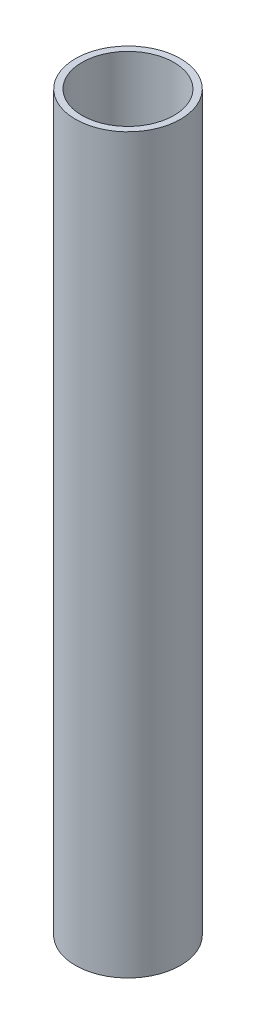
ISO-10303-21;
HEADER;
FILE_DESCRIPTION(('STEP AP214'),'2;1');
FILE_NAME('part.step','',(''),(''),'','','');
FILE_SCHEMA(('AUTOMOTIVE_DESIGN { 1 0 10303 214 1 1 1 1 }'));
ENDSEC;
DATA;
#1=APPLICATION_CONTEXT('core data for automotive mechanical design processes');
#2=APPLICATION_PROTOCOL_DEFINITION('international standard','automotive_design',2000,#1);
#3=PRODUCT_CONTEXT('',#1,'mechanical');
#4=PRODUCT('Part','Part','',(#3));
#5=PRODUCT_RELATED_PRODUCT_CATEGORY('part','',(#4));
#6=PRODUCT_DEFINITION_FORMATION('','',#4);
#7=PRODUCT_DEFINITION_CONTEXT('part definition',#1,'design');
#8=PRODUCT_DEFINITION('design','',#6,#7);
#9=PRODUCT_DEFINITION_SHAPE('','',#8);
#10=(LENGTH_UNIT() NAMED_UNIT(*) SI_UNIT(.MILLI.,.METRE.));
#11=(NAMED_UNIT(*) PLANE_ANGLE_UNIT() SI_UNIT($,.RADIAN.));
#12=(NAMED_UNIT(*) SI_UNIT($,.STERADIAN.) SOLID_ANGLE_UNIT());
#13=UNCERTAINTY_MEASURE_WITH_UNIT(LENGTH_MEASURE(1.E-05),#10,'distance_accuracy_value','');
#14=(GEOMETRIC_REPRESENTATION_CONTEXT(3) GLOBAL_UNCERTAINTY_ASSIGNED_CONTEXT((#13)) GLOBAL_UNIT_ASSIGNED_CONTEXT((#10,
#11,#12)) REPRESENTATION_CONTEXT('',''));
#15=CARTESIAN_POINT('',(0.,0.,0.));
#16=DIRECTION('',(0.,0.,1.));
#17=DIRECTION('',(1.,0.,0.));
#18=AXIS2_PLACEMENT_3D('',#15,#16,#17);
#19=CARTESIAN_POINT('',(0.,170.,0.));
#20=DIRECTION('',(0.,1.,0.));
#21=DIRECTION('',(0.,0.,1.));
#22=AXIS2_PLACEMENT_3D('',#19,#20,#21);
#23=PLANE('',#22);
#24=CARTESIAN_POINT('',(0.,170.,0.));
#25=DIRECTION('',(0.,1.,0.));
#26=DIRECTION('',(0.,0.,1.));
#27=AXIS2_PLACEMENT_3D('',#24,#25,#26);
#28=CIRCLE('',#27,12.192);
#29=CARTESIAN_POINT('',(0.,170.,12.192));
#30=VERTEX_POINT('',#29);
#31=EDGE_CURVE('E10',#30,#30,#28,.T.);
#32=ORIENTED_EDGE('',*,*,#31,.T.);
#33=EDGE_LOOP('',(#32));
#34=FACE_BOUND('',#33,.T.);
#35=CARTESIAN_POINT('',(0.,170.,0.));
#36=DIRECTION('',(0.,1.,0.));
#37=DIRECTION('',(0.,0.,1.));
#38=AXIS2_PLACEMENT_3D('',#35,#36,#37);
#39=CIRCLE('',#38,10.668);
#40=CARTESIAN_POINT('',(0.,170.,10.668));
#41=VERTEX_POINT('',#40);
#42=EDGE_CURVE('E42',#41,#41,#39,.T.);
#43=ORIENTED_EDGE('',*,*,#42,.F.);
#44=EDGE_LOOP('',(#43));
#45=FACE_BOUND('',#44,.T.);
#46=ADVANCED_FACE('F31',(#34,#45),#23,.T.);
#47=CARTESIAN_POINT('',(0.,0.,0.));
#48=DIRECTION('',(0.,1.,0.));
#49=DIRECTION('',(0.,0.,1.));
#50=AXIS2_PLACEMENT_3D('',#47,#48,#49);
#51=PLANE('',#50);
#52=CARTESIAN_POINT('',(0.,0.,0.));
#53=DIRECTION('',(0.,1.,0.));
#54=DIRECTION('',(0.,0.,1.));
#55=AXIS2_PLACEMENT_3D('',#52,#53,#54);
#56=CIRCLE('',#55,12.192);
#57=CARTESIAN_POINT('',(0.,0.,12.192));
#58=VERTEX_POINT('',#57);
#59=EDGE_CURVE('E35',#58,#58,#56,.T.);
#60=ORIENTED_EDGE('',*,*,#59,.F.);
#61=EDGE_LOOP('',(#60));
#62=FACE_BOUND('',#61,.T.);
#63=CARTESIAN_POINT('',(0.,0.,0.));
#64=DIRECTION('',(0.,1.,0.));
#65=DIRECTION('',(0.,0.,1.));
#66=AXIS2_PLACEMENT_3D('',#63,#64,#65);
#67=CIRCLE('',#66,10.668);
#68=CARTESIAN_POINT('',(0.,0.,10.668));
#69=VERTEX_POINT('',#68);
#70=EDGE_CURVE('E44',#69,#69,#67,.T.);
#71=ORIENTED_EDGE('',*,*,#70,.T.);
#72=EDGE_LOOP('',(#71));
#73=FACE_BOUND('',#72,.T.);
#74=ADVANCED_FACE('F54',(#62,#73),#51,.F.);
#75=CARTESIAN_POINT('',(0.,170.,0.));
#76=DIRECTION('',(0.,-1.,0.));
#77=DIRECTION('',(0.,0.,-1.));
#78=AXIS2_PLACEMENT_3D('',#75,#76,#77);
#79=CYLINDRICAL_SURFACE('',#78,12.192);
#80=ORIENTED_EDGE('',*,*,#31,.F.);
#81=EDGE_LOOP('',(#80));
#82=FACE_BOUND('',#81,.T.);
#83=ORIENTED_EDGE('',*,*,#59,.T.);
#84=EDGE_LOOP('',(#83));
#85=FACE_BOUND('',#84,.T.);
#86=ADVANCED_FACE('F33',(#82,#85),#79,.T.);
#87=CARTESIAN_POINT('',(0.,170.,0.));
#88=DIRECTION('',(0.,-1.,0.));
#89=DIRECTION('',(0.,0.,-1.));
#90=AXIS2_PLACEMENT_3D('',#87,#88,#89);
#91=CYLINDRICAL_SURFACE('',#90,10.668);
#92=ORIENTED_EDGE('',*,*,#42,.T.);
#93=EDGE_LOOP('',(#92));
#94=FACE_BOUND('',#93,.T.);
#95=ORIENTED_EDGE('',*,*,#70,.F.);
#96=EDGE_LOOP('',(#95));
#97=FACE_BOUND('',#96,.T.);
#98=ADVANCED_FACE('F50',(#94,#97),#91,.F.);
#99=CLOSED_SHELL('',(#46,#74,#86,#98));
#100=MANIFOLD_SOLID_BREP('B2',#99);
#101=ADVANCED_BREP_SHAPE_REPRESENTATION('',(#18,#100),#14);
#102=SHAPE_DEFINITION_REPRESENTATION(#9,#101);
ENDSEC;
END-ISO-10303-21;
